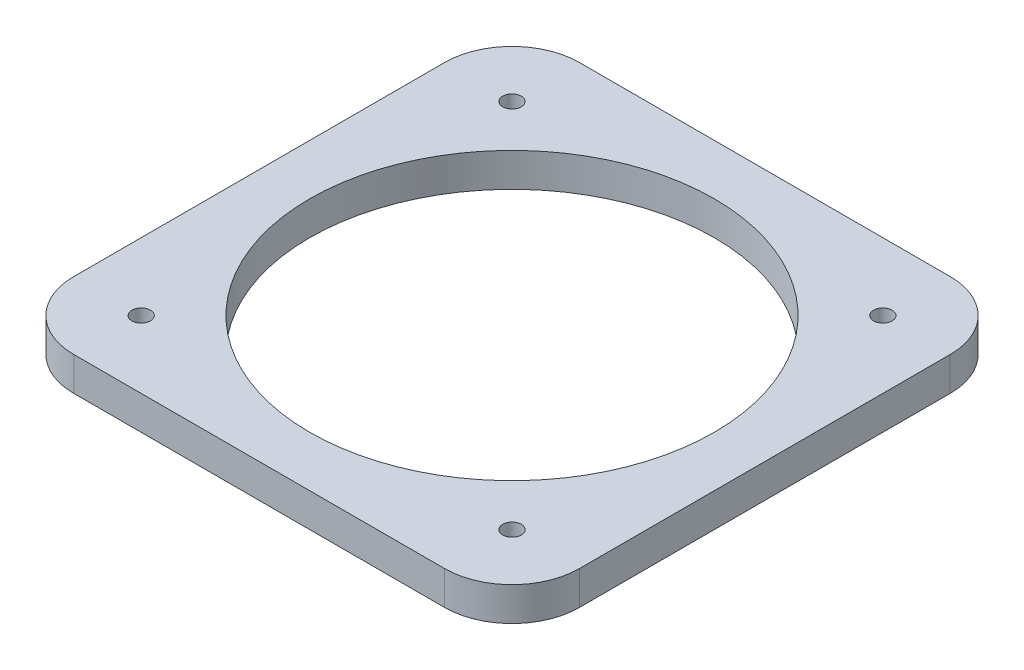
ISO-10303-21;
HEADER;
FILE_DESCRIPTION(('STEP AP214'),'2;1');
FILE_NAME('part.step','',(''),(''),'','','');
FILE_SCHEMA(('AUTOMOTIVE_DESIGN { 1 0 10303 214 1 1 1 1 }'));
ENDSEC;
DATA;
#1=APPLICATION_CONTEXT('core data for automotive mechanical design processes');
#2=APPLICATION_PROTOCOL_DEFINITION('international standard','automotive_design',2000,#1);
#3=PRODUCT_CONTEXT('',#1,'mechanical');
#4=PRODUCT('Part','Part','',(#3));
#5=PRODUCT_RELATED_PRODUCT_CATEGORY('part','',(#4));
#6=PRODUCT_DEFINITION_FORMATION('','',#4);
#7=PRODUCT_DEFINITION_CONTEXT('part definition',#1,'design');
#8=PRODUCT_DEFINITION('design','',#6,#7);
#9=PRODUCT_DEFINITION_SHAPE('','',#8);
#10=(LENGTH_UNIT() NAMED_UNIT(*) SI_UNIT(.MILLI.,.METRE.));
#11=(NAMED_UNIT(*) PLANE_ANGLE_UNIT() SI_UNIT($,.RADIAN.));
#12=(NAMED_UNIT(*) SI_UNIT($,.STERADIAN.) SOLID_ANGLE_UNIT());
#13=UNCERTAINTY_MEASURE_WITH_UNIT(LENGTH_MEASURE(1.E-05),#10,'distance_accuracy_value','');
#14=(GEOMETRIC_REPRESENTATION_CONTEXT(3) GLOBAL_UNCERTAINTY_ASSIGNED_CONTEXT((#13)) GLOBAL_UNIT_ASSIGNED_CONTEXT((#10,
#11,#12)) REPRESENTATION_CONTEXT('',''));
#15=CARTESIAN_POINT('',(0.,0.,0.));
#16=DIRECTION('',(0.,0.,1.));
#17=DIRECTION('',(1.,0.,0.));
#18=AXIS2_PLACEMENT_3D('',#15,#16,#17);
#19=CARTESIAN_POINT('',(0.,6.35,0.));
#20=DIRECTION('',(0.,1.,0.));
#21=DIRECTION('',(0.,0.,1.));
#22=AXIS2_PLACEMENT_3D('',#19,#20,#21);
#23=PLANE('',#22);
#24=CARTESIAN_POINT('',(-34.9250000000004,6.35,34.9249999999996));
#25=DIRECTION('',(0.,1.,0.));
#26=DIRECTION('',(1.,0.,0.));
#27=AXIS2_PLACEMENT_3D('',#24,#25,#26);
#28=CIRCLE('',#27,1.75);
#29=CARTESIAN_POINT('',(-33.1750000000004,6.35,34.9249999999996));
#30=VERTEX_POINT('',#29);
#31=EDGE_CURVE('E200',#30,#30,#28,.T.);
#32=ORIENTED_EDGE('',*,*,#31,.F.);
#33=EDGE_LOOP('',(#32));
#34=FACE_BOUND('',#33,.T.);
#35=CARTESIAN_POINT('',(34.925,6.35,34.925));
#36=DIRECTION('',(0.,1.,0.));
#37=DIRECTION('',(0.,0.,-1.));
#38=AXIS2_PLACEMENT_3D('',#35,#36,#37);
#39=CIRCLE('',#38,1.75);
#40=CARTESIAN_POINT('',(34.925,6.35,33.175));
#41=VERTEX_POINT('',#40);
#42=EDGE_CURVE('E194',#41,#41,#39,.T.);
#43=ORIENTED_EDGE('',*,*,#42,.F.);
#44=EDGE_LOOP('',(#43));
#45=FACE_BOUND('',#44,.T.);
#46=CARTESIAN_POINT('',(34.9250000000001,6.35,-34.9249999999999));
#47=DIRECTION('',(0.,1.,0.));
#48=DIRECTION('',(-1.,0.,0.));
#49=AXIS2_PLACEMENT_3D('',#46,#47,#48);
#50=CIRCLE('',#49,1.75);
#51=CARTESIAN_POINT('',(33.1750000000001,6.35,-34.9249999999999));
#52=VERTEX_POINT('',#51);
#53=EDGE_CURVE('E188',#52,#52,#50,.T.);
#54=ORIENTED_EDGE('',*,*,#53,.F.);
#55=EDGE_LOOP('',(#54));
#56=FACE_BOUND('',#55,.T.);
#57=CARTESIAN_POINT('',(-34.925,6.35,-34.925));
#58=DIRECTION('',(0.,1.,0.));
#59=DIRECTION('',(0.,0.,1.));
#60=AXIS2_PLACEMENT_3D('',#57,#58,#59);
#61=CIRCLE('',#60,1.75);
#62=CARTESIAN_POINT('',(-34.925,6.35,-33.175));
#63=VERTEX_POINT('',#62);
#64=EDGE_CURVE('E182',#63,#63,#61,.T.);
#65=ORIENTED_EDGE('',*,*,#64,.F.);
#66=EDGE_LOOP('',(#65));
#67=FACE_BOUND('',#66,.T.);
#68=DIRECTION('',(-1.,0.,0.));
#69=VECTOR('',#68,1.);
#70=CARTESIAN_POINT('',(47.625,6.35,-47.625));
#71=LINE('',#70,#69);
#72=CARTESIAN_POINT('',(34.925,6.35,-47.625));
#73=VERTEX_POINT('',#72);
#74=CARTESIAN_POINT('',(-34.925,6.35,-47.625));
#75=VERTEX_POINT('',#74);
#76=EDGE_CURVE('E135',#73,#75,#71,.T.);
#77=ORIENTED_EDGE('',*,*,#76,.T.);
#78=CARTESIAN_POINT('',(-34.925,6.35,-34.925));
#79=DIRECTION('',(0.,1.,0.));
#80=DIRECTION('',(0.,0.,1.));
#81=AXIS2_PLACEMENT_3D('',#78,#79,#80);
#82=CIRCLE('',#81,12.7);
#83=CARTESIAN_POINT('',(-47.625,6.35,-34.925));
#84=VERTEX_POINT('',#83);
#85=EDGE_CURVE('E154',#75,#84,#82,.T.);
#86=ORIENTED_EDGE('',*,*,#85,.T.);
#87=DIRECTION('',(0.,0.,1.));
#88=VECTOR('',#87,1.);
#89=CARTESIAN_POINT('',(-47.625,6.35,47.625));
#90=LINE('',#89,#88);
#91=CARTESIAN_POINT('',(-47.625,6.35,34.925));
#92=VERTEX_POINT('',#91);
#93=EDGE_CURVE('E118',#84,#92,#90,.T.);
#94=ORIENTED_EDGE('',*,*,#93,.T.);
#95=CARTESIAN_POINT('',(-34.925,6.35,34.925));
#96=DIRECTION('',(0.,1.,0.));
#97=DIRECTION('',(0.,0.,1.));
#98=AXIS2_PLACEMENT_3D('',#95,#96,#97);
#99=CIRCLE('',#98,12.7);
#100=CARTESIAN_POINT('',(-34.925,6.35,47.625));
#101=VERTEX_POINT('',#100);
#102=EDGE_CURVE('E152',#92,#101,#99,.T.);
#103=ORIENTED_EDGE('',*,*,#102,.T.);
#104=DIRECTION('',(1.,0.,0.));
#105=VECTOR('',#104,1.);
#106=CARTESIAN_POINT('',(47.625,6.35,47.625));
#107=LINE('',#106,#105);
#108=CARTESIAN_POINT('',(34.925,6.35,47.625));
#109=VERTEX_POINT('',#108);
#110=EDGE_CURVE('E165',#101,#109,#107,.T.);
#111=ORIENTED_EDGE('',*,*,#110,.T.);
#112=CARTESIAN_POINT('',(34.925,6.35,34.925));
#113=DIRECTION('',(0.,1.,0.));
#114=DIRECTION('',(0.,0.,1.));
#115=AXIS2_PLACEMENT_3D('',#112,#113,#114);
#116=CIRCLE('',#115,12.7);
#117=CARTESIAN_POINT('',(47.625,6.35,34.925));
#118=VERTEX_POINT('',#117);
#119=EDGE_CURVE('E53',#109,#118,#116,.T.);
#120=ORIENTED_EDGE('',*,*,#119,.T.);
#121=DIRECTION('',(0.,0.,-1.));
#122=VECTOR('',#121,1.);
#123=CARTESIAN_POINT('',(47.625,6.35,47.625));
#124=LINE('',#123,#122);
#125=CARTESIAN_POINT('',(47.625,6.35,-34.925));
#126=VERTEX_POINT('',#125);
#127=EDGE_CURVE('E173',#118,#126,#124,.T.);
#128=ORIENTED_EDGE('',*,*,#127,.T.);
#129=CARTESIAN_POINT('',(34.925,6.35,-34.925));
#130=DIRECTION('',(0.,1.,0.));
#131=DIRECTION('',(0.,0.,1.));
#132=AXIS2_PLACEMENT_3D('',#129,#130,#131);
#133=CIRCLE('',#132,12.7);
#134=EDGE_CURVE('E149',#126,#73,#133,.T.);
#135=ORIENTED_EDGE('',*,*,#134,.T.);
#136=EDGE_LOOP('',(#77,#86,#94,#103,#111,#120,#128,#135));
#137=FACE_BOUND('',#136,.T.);
#138=CARTESIAN_POINT('',(0.,6.35,0.));
#139=DIRECTION('',(0.,1.,0.));
#140=DIRECTION('',(0.,0.,1.));
#141=AXIS2_PLACEMENT_3D('',#138,#139,#140);
#142=CIRCLE('',#141,38.1);
#143=CARTESIAN_POINT('',(0.,6.35,38.1));
#144=VERTEX_POINT('',#143);
#145=EDGE_CURVE('E126',#144,#144,#142,.T.);
#146=ORIENTED_EDGE('',*,*,#145,.F.);
#147=EDGE_LOOP('',(#146));
#148=FACE_BOUND('',#147,.T.);
#149=ADVANCED_FACE('F32',(#34,#45,#56,#67,#137,#148),#23,.T.);
#150=CARTESIAN_POINT('',(0.,0.,0.));
#151=DIRECTION('',(0.,1.,0.));
#152=DIRECTION('',(0.,0.,1.));
#153=AXIS2_PLACEMENT_3D('',#150,#151,#152);
#154=PLANE('',#153);
#155=CARTESIAN_POINT('',(-34.9250000000004,0.,34.9249999999996));
#156=DIRECTION('',(0.,1.,0.));
#157=DIRECTION('',(1.,0.,0.));
#158=AXIS2_PLACEMENT_3D('',#155,#156,#157);
#159=CIRCLE('',#158,1.75);
#160=CARTESIAN_POINT('',(-33.1750000000004,0.,34.9249999999996));
#161=VERTEX_POINT('',#160);
#162=EDGE_CURVE('E197',#161,#161,#159,.T.);
#163=ORIENTED_EDGE('',*,*,#162,.T.);
#164=EDGE_LOOP('',(#163));
#165=FACE_BOUND('',#164,.T.);
#166=CARTESIAN_POINT('',(34.925,0.,34.925));
#167=DIRECTION('',(0.,1.,0.));
#168=DIRECTION('',(0.,0.,-1.));
#169=AXIS2_PLACEMENT_3D('',#166,#167,#168);
#170=CIRCLE('',#169,1.75);
#171=CARTESIAN_POINT('',(34.925,0.,33.175));
#172=VERTEX_POINT('',#171);
#173=EDGE_CURVE('E191',#172,#172,#170,.T.);
#174=ORIENTED_EDGE('',*,*,#173,.T.);
#175=EDGE_LOOP('',(#174));
#176=FACE_BOUND('',#175,.T.);
#177=CARTESIAN_POINT('',(34.9250000000001,0.,-34.9249999999999));
#178=DIRECTION('',(0.,1.,0.));
#179=DIRECTION('',(-1.,0.,0.));
#180=AXIS2_PLACEMENT_3D('',#177,#178,#179);
#181=CIRCLE('',#180,1.75);
#182=CARTESIAN_POINT('',(33.1750000000001,0.,-34.9249999999999));
#183=VERTEX_POINT('',#182);
#184=EDGE_CURVE('E185',#183,#183,#181,.T.);
#185=ORIENTED_EDGE('',*,*,#184,.T.);
#186=EDGE_LOOP('',(#185));
#187=FACE_BOUND('',#186,.T.);
#188=CARTESIAN_POINT('',(-34.925,0.,-34.925));
#189=DIRECTION('',(0.,1.,0.));
#190=DIRECTION('',(0.,0.,1.));
#191=AXIS2_PLACEMENT_3D('',#188,#189,#190);
#192=CIRCLE('',#191,1.75);
#193=CARTESIAN_POINT('',(-34.925,0.,-33.175));
#194=VERTEX_POINT('',#193);
#195=EDGE_CURVE('E180',#194,#194,#192,.T.);
#196=ORIENTED_EDGE('',*,*,#195,.T.);
#197=EDGE_LOOP('',(#196));
#198=FACE_BOUND('',#197,.T.);
#199=DIRECTION('',(0.,0.,1.));
#200=VECTOR('',#199,1.);
#201=CARTESIAN_POINT('',(-47.625,0.,47.625));
#202=LINE('',#201,#200);
#203=CARTESIAN_POINT('',(-47.625,0.,-34.925));
#204=VERTEX_POINT('',#203);
#205=CARTESIAN_POINT('',(-47.625,0.,34.925));
#206=VERTEX_POINT('',#205);
#207=EDGE_CURVE('E115',#204,#206,#202,.T.);
#208=ORIENTED_EDGE('',*,*,#207,.F.);
#209=CARTESIAN_POINT('',(-34.925,0.,-34.925));
#210=DIRECTION('',(0.,1.,0.));
#211=DIRECTION('',(0.,0.,1.));
#212=AXIS2_PLACEMENT_3D('',#209,#210,#211);
#213=CIRCLE('',#212,12.7);
#214=CARTESIAN_POINT('',(-34.925,0.,-47.625));
#215=VERTEX_POINT('',#214);
#216=EDGE_CURVE('E98',#204,#215,#213,.F.);
#217=ORIENTED_EDGE('',*,*,#216,.T.);
#218=DIRECTION('',(-1.,0.,0.));
#219=VECTOR('',#218,1.);
#220=CARTESIAN_POINT('',(47.625,0.,-47.625));
#221=LINE('',#220,#219);
#222=CARTESIAN_POINT('',(34.925,0.,-47.625));
#223=VERTEX_POINT('',#222);
#224=EDGE_CURVE('E139',#223,#215,#221,.T.);
#225=ORIENTED_EDGE('',*,*,#224,.F.);
#226=CARTESIAN_POINT('',(34.925,0.,-34.925));
#227=DIRECTION('',(0.,1.,0.));
#228=DIRECTION('',(0.,0.,1.));
#229=AXIS2_PLACEMENT_3D('',#226,#227,#228);
#230=CIRCLE('',#229,12.7);
#231=CARTESIAN_POINT('',(47.625,0.,-34.925));
#232=VERTEX_POINT('',#231);
#233=EDGE_CURVE('E119',#223,#232,#230,.F.);
#234=ORIENTED_EDGE('',*,*,#233,.T.);
#235=DIRECTION('',(0.,0.,-1.));
#236=VECTOR('',#235,1.);
#237=CARTESIAN_POINT('',(47.625,0.,47.625));
#238=LINE('',#237,#236);
#239=CARTESIAN_POINT('',(47.625,0.,34.925));
#240=VERTEX_POINT('',#239);
#241=EDGE_CURVE('E129',#240,#232,#238,.T.);
#242=ORIENTED_EDGE('',*,*,#241,.F.);
#243=CARTESIAN_POINT('',(34.925,0.,34.925));
#244=DIRECTION('',(0.,1.,0.));
#245=DIRECTION('',(0.,0.,1.));
#246=AXIS2_PLACEMENT_3D('',#243,#244,#245);
#247=CIRCLE('',#246,12.7);
#248=CARTESIAN_POINT('',(34.925,0.,47.625));
#249=VERTEX_POINT('',#248);
#250=EDGE_CURVE('E143',#240,#249,#247,.F.);
#251=ORIENTED_EDGE('',*,*,#250,.T.);
#252=DIRECTION('',(1.,0.,0.));
#253=VECTOR('',#252,1.);
#254=CARTESIAN_POINT('',(47.625,0.,47.625));
#255=LINE('',#254,#253);
#256=CARTESIAN_POINT('',(-34.925,0.,47.625));
#257=VERTEX_POINT('',#256);
#258=EDGE_CURVE('E125',#257,#249,#255,.T.);
#259=ORIENTED_EDGE('',*,*,#258,.F.);
#260=CARTESIAN_POINT('',(-34.925,0.,34.925));
#261=DIRECTION('',(0.,1.,0.));
#262=DIRECTION('',(0.,0.,1.));
#263=AXIS2_PLACEMENT_3D('',#260,#261,#262);
#264=CIRCLE('',#263,12.7);
#265=EDGE_CURVE('E109',#257,#206,#264,.F.);
#266=ORIENTED_EDGE('',*,*,#265,.T.);
#267=EDGE_LOOP('',(#208,#217,#225,#234,#242,#251,#259,#266));
#268=FACE_BOUND('',#267,.T.);
#269=CARTESIAN_POINT('',(0.,0.,0.));
#270=DIRECTION('',(0.,1.,0.));
#271=DIRECTION('',(0.,0.,1.));
#272=AXIS2_PLACEMENT_3D('',#269,#270,#271);
#273=CIRCLE('',#272,38.1);
#274=CARTESIAN_POINT('',(0.,0.,38.1));
#275=VERTEX_POINT('',#274);
#276=EDGE_CURVE('E132',#275,#275,#273,.T.);
#277=ORIENTED_EDGE('',*,*,#276,.T.);
#278=EDGE_LOOP('',(#277));
#279=FACE_BOUND('',#278,.T.);
#280=ADVANCED_FACE('F122',(#165,#176,#187,#198,#268,#279),#154,.F.);
#281=CARTESIAN_POINT('',(-47.625,6.35,47.625));
#282=DIRECTION('',(1.,0.,0.));
#283=DIRECTION('',(0.,0.,-1.));
#284=AXIS2_PLACEMENT_3D('',#281,#282,#283);
#285=PLANE('',#284);
#286=ORIENTED_EDGE('',*,*,#93,.F.);
#287=DIRECTION('',(0.,-1.,0.));
#288=VECTOR('',#287,1.);
#289=CARTESIAN_POINT('',(-47.625,6.35,-34.925));
#290=LINE('',#289,#288);
#291=EDGE_CURVE('E102',#84,#204,#290,.T.);
#292=ORIENTED_EDGE('',*,*,#291,.T.);
#293=ORIENTED_EDGE('',*,*,#207,.T.);
#294=DIRECTION('',(0.,-1.,0.));
#295=VECTOR('',#294,1.);
#296=CARTESIAN_POINT('',(-47.625,6.35,34.925));
#297=LINE('',#296,#295);
#298=EDGE_CURVE('E120',#206,#92,#297,.F.);
#299=ORIENTED_EDGE('',*,*,#298,.T.);
#300=EDGE_LOOP('',(#286,#292,#293,#299));
#301=FACE_BOUND('',#300,.T.);
#302=ADVANCED_FACE('F114',(#301),#285,.F.);
#303=CARTESIAN_POINT('',(47.625,6.35,47.625));
#304=DIRECTION('',(0.,0.,-1.));
#305=DIRECTION('',(-1.,0.,0.));
#306=AXIS2_PLACEMENT_3D('',#303,#304,#305);
#307=PLANE('',#306);
#308=ORIENTED_EDGE('',*,*,#110,.F.);
#309=DIRECTION('',(0.,-1.,0.));
#310=VECTOR('',#309,1.);
#311=CARTESIAN_POINT('',(-34.925,6.35,47.625));
#312=LINE('',#311,#310);
#313=EDGE_CURVE('E158',#101,#257,#312,.T.);
#314=ORIENTED_EDGE('',*,*,#313,.T.);
#315=ORIENTED_EDGE('',*,*,#258,.T.);
#316=DIRECTION('',(0.,-1.,0.));
#317=VECTOR('',#316,1.);
#318=CARTESIAN_POINT('',(34.925,6.35,47.625));
#319=LINE('',#318,#317);
#320=EDGE_CURVE('E156',#249,#109,#319,.F.);
#321=ORIENTED_EDGE('',*,*,#320,.T.);
#322=EDGE_LOOP('',(#308,#314,#315,#321));
#323=FACE_BOUND('',#322,.T.);
#324=ADVANCED_FACE('F163',(#323),#307,.F.);
#325=CARTESIAN_POINT('',(47.625,6.35,47.625));
#326=DIRECTION('',(-1.,0.,0.));
#327=DIRECTION('',(0.,0.,1.));
#328=AXIS2_PLACEMENT_3D('',#325,#326,#327);
#329=PLANE('',#328);
#330=ORIENTED_EDGE('',*,*,#127,.F.);
#331=DIRECTION('',(0.,-1.,0.));
#332=VECTOR('',#331,1.);
#333=CARTESIAN_POINT('',(47.625,6.35,34.925));
#334=LINE('',#333,#332);
#335=EDGE_CURVE('E11',#118,#240,#334,.T.);
#336=ORIENTED_EDGE('',*,*,#335,.T.);
#337=ORIENTED_EDGE('',*,*,#241,.T.);
#338=DIRECTION('',(0.,-1.,0.));
#339=VECTOR('',#338,1.);
#340=CARTESIAN_POINT('',(47.625,6.35,-34.925));
#341=LINE('',#340,#339);
#342=EDGE_CURVE('E40',#232,#126,#341,.F.);
#343=ORIENTED_EDGE('',*,*,#342,.T.);
#344=EDGE_LOOP('',(#330,#336,#337,#343));
#345=FACE_BOUND('',#344,.T.);
#346=ADVANCED_FACE('F172',(#345),#329,.F.);
#347=CARTESIAN_POINT('',(47.625,6.35,-47.625));
#348=DIRECTION('',(0.,0.,1.));
#349=DIRECTION('',(1.,0.,0.));
#350=AXIS2_PLACEMENT_3D('',#347,#348,#349);
#351=PLANE('',#350);
#352=ORIENTED_EDGE('',*,*,#224,.T.);
#353=DIRECTION('',(0.,-1.,0.));
#354=VECTOR('',#353,1.);
#355=CARTESIAN_POINT('',(-34.925,6.35,-47.625));
#356=LINE('',#355,#354);
#357=EDGE_CURVE('E103',#215,#75,#356,.F.);
#358=ORIENTED_EDGE('',*,*,#357,.T.);
#359=ORIENTED_EDGE('',*,*,#76,.F.);
#360=DIRECTION('',(0.,-1.,0.));
#361=VECTOR('',#360,1.);
#362=CARTESIAN_POINT('',(34.925,6.35,-47.625));
#363=LINE('',#362,#361);
#364=EDGE_CURVE('E108',#73,#223,#363,.T.);
#365=ORIENTED_EDGE('',*,*,#364,.T.);
#366=EDGE_LOOP('',(#352,#358,#359,#365));
#367=FACE_BOUND('',#366,.T.);
#368=ADVANCED_FACE('F231',(#367),#351,.F.);
#369=CARTESIAN_POINT('',(0.,6.35,0.));
#370=DIRECTION('',(0.,-1.,0.));
#371=DIRECTION('',(0.,0.,-1.));
#372=AXIS2_PLACEMENT_3D('',#369,#370,#371);
#373=CYLINDRICAL_SURFACE('',#372,38.1);
#374=ORIENTED_EDGE('',*,*,#145,.T.);
#375=EDGE_LOOP('',(#374));
#376=FACE_BOUND('',#375,.T.);
#377=ORIENTED_EDGE('',*,*,#276,.F.);
#378=EDGE_LOOP('',(#377));
#379=FACE_BOUND('',#378,.T.);
#380=ADVANCED_FACE('F227',(#376,#379),#373,.F.);
#381=CARTESIAN_POINT('',(-34.925,0.,-34.925));
#382=DIRECTION('',(0.,1.,0.));
#383=DIRECTION('',(0.,0.,1.));
#384=AXIS2_PLACEMENT_3D('',#381,#382,#383);
#385=CYLINDRICAL_SURFACE('',#384,1.75);
#386=ORIENTED_EDGE('',*,*,#195,.F.);
#387=EDGE_LOOP('',(#386));
#388=FACE_BOUND('',#387,.T.);
#389=ORIENTED_EDGE('',*,*,#64,.T.);
#390=EDGE_LOOP('',(#389));
#391=FACE_BOUND('',#390,.T.);
#392=ADVANCED_FACE('F230',(#388,#391),#385,.F.);
#393=CARTESIAN_POINT('',(34.9250000000001,0.,-34.9249999999999));
#394=DIRECTION('',(0.,1.,0.));
#395=DIRECTION('',(0.,0.,1.));
#396=AXIS2_PLACEMENT_3D('',#393,#394,#395);
#397=CYLINDRICAL_SURFACE('',#396,1.75);
#398=ORIENTED_EDGE('',*,*,#184,.F.);
#399=EDGE_LOOP('',(#398));
#400=FACE_BOUND('',#399,.T.);
#401=ORIENTED_EDGE('',*,*,#53,.T.);
#402=EDGE_LOOP('',(#401));
#403=FACE_BOUND('',#402,.T.);
#404=ADVANCED_FACE('F326',(#400,#403),#397,.F.);
#405=CARTESIAN_POINT('',(34.925,0.,34.925));
#406=DIRECTION('',(0.,1.,0.));
#407=DIRECTION('',(0.,0.,1.));
#408=AXIS2_PLACEMENT_3D('',#405,#406,#407);
#409=CYLINDRICAL_SURFACE('',#408,1.75);
#410=ORIENTED_EDGE('',*,*,#173,.F.);
#411=EDGE_LOOP('',(#410));
#412=FACE_BOUND('',#411,.T.);
#413=ORIENTED_EDGE('',*,*,#42,.T.);
#414=EDGE_LOOP('',(#413));
#415=FACE_BOUND('',#414,.T.);
#416=ADVANCED_FACE('F211',(#412,#415),#409,.F.);
#417=CARTESIAN_POINT('',(-34.9250000000004,0.,34.9249999999996));
#418=DIRECTION('',(0.,1.,0.));
#419=DIRECTION('',(0.,0.,1.));
#420=AXIS2_PLACEMENT_3D('',#417,#418,#419);
#421=CYLINDRICAL_SURFACE('',#420,1.75);
#422=ORIENTED_EDGE('',*,*,#162,.F.);
#423=EDGE_LOOP('',(#422));
#424=FACE_BOUND('',#423,.T.);
#425=ORIENTED_EDGE('',*,*,#31,.T.);
#426=EDGE_LOOP('',(#425));
#427=FACE_BOUND('',#426,.T.);
#428=ADVANCED_FACE('F208',(#424,#427),#421,.F.);
#429=CARTESIAN_POINT('',(-34.925,6.35,-34.925));
#430=DIRECTION('',(0.,-1.,0.));
#431=DIRECTION('',(0.,0.,-1.));
#432=AXIS2_PLACEMENT_3D('',#429,#430,#431);
#433=CYLINDRICAL_SURFACE('',#432,12.7);
#434=ORIENTED_EDGE('',*,*,#85,.F.);
#435=ORIENTED_EDGE('',*,*,#357,.F.);
#436=ORIENTED_EDGE('',*,*,#216,.F.);
#437=ORIENTED_EDGE('',*,*,#291,.F.);
#438=EDGE_LOOP('',(#434,#435,#436,#437));
#439=FACE_BOUND('',#438,.T.);
#440=ADVANCED_FACE('F101',(#439),#433,.T.);
#441=CARTESIAN_POINT('',(-34.925,6.35,34.925));
#442=DIRECTION('',(0.,-1.,0.));
#443=DIRECTION('',(0.,0.,-1.));
#444=AXIS2_PLACEMENT_3D('',#441,#442,#443);
#445=CYLINDRICAL_SURFACE('',#444,12.7);
#446=ORIENTED_EDGE('',*,*,#102,.F.);
#447=ORIENTED_EDGE('',*,*,#298,.F.);
#448=ORIENTED_EDGE('',*,*,#265,.F.);
#449=ORIENTED_EDGE('',*,*,#313,.F.);
#450=EDGE_LOOP('',(#446,#447,#448,#449));
#451=FACE_BOUND('',#450,.T.);
#452=ADVANCED_FACE('F250',(#451),#445,.T.);
#453=CARTESIAN_POINT('',(34.925,6.35,34.925));
#454=DIRECTION('',(0.,-1.,0.));
#455=DIRECTION('',(0.,0.,-1.));
#456=AXIS2_PLACEMENT_3D('',#453,#454,#455);
#457=CYLINDRICAL_SURFACE('',#456,12.7);
#458=ORIENTED_EDGE('',*,*,#119,.F.);
#459=ORIENTED_EDGE('',*,*,#320,.F.);
#460=ORIENTED_EDGE('',*,*,#250,.F.);
#461=ORIENTED_EDGE('',*,*,#335,.F.);
#462=EDGE_LOOP('',(#458,#459,#460,#461));
#463=FACE_BOUND('',#462,.T.);
#464=ADVANCED_FACE('F171',(#463),#457,.T.);
#465=CARTESIAN_POINT('',(34.925,6.35,-34.925));
#466=DIRECTION('',(0.,-1.,0.));
#467=DIRECTION('',(0.,0.,-1.));
#468=AXIS2_PLACEMENT_3D('',#465,#466,#467);
#469=CYLINDRICAL_SURFACE('',#468,12.7);
#470=ORIENTED_EDGE('',*,*,#134,.F.);
#471=ORIENTED_EDGE('',*,*,#342,.F.);
#472=ORIENTED_EDGE('',*,*,#233,.F.);
#473=ORIENTED_EDGE('',*,*,#364,.F.);
#474=EDGE_LOOP('',(#470,#471,#472,#473));
#475=FACE_BOUND('',#474,.T.);
#476=ADVANCED_FACE('F34',(#475),#469,.T.);
#477=CLOSED_SHELL('',(#149,#280,#302,#324,#346,#368,#380,#392,#404,#416,#428,#440,#452,#464,#476));
#478=MANIFOLD_SOLID_BREP('B2',#477);
#479=ADVANCED_BREP_SHAPE_REPRESENTATION('',(#18,#478),#14);
#480=SHAPE_DEFINITION_REPRESENTATION(#9,#479);
ENDSEC;
END-ISO-10303-21;
